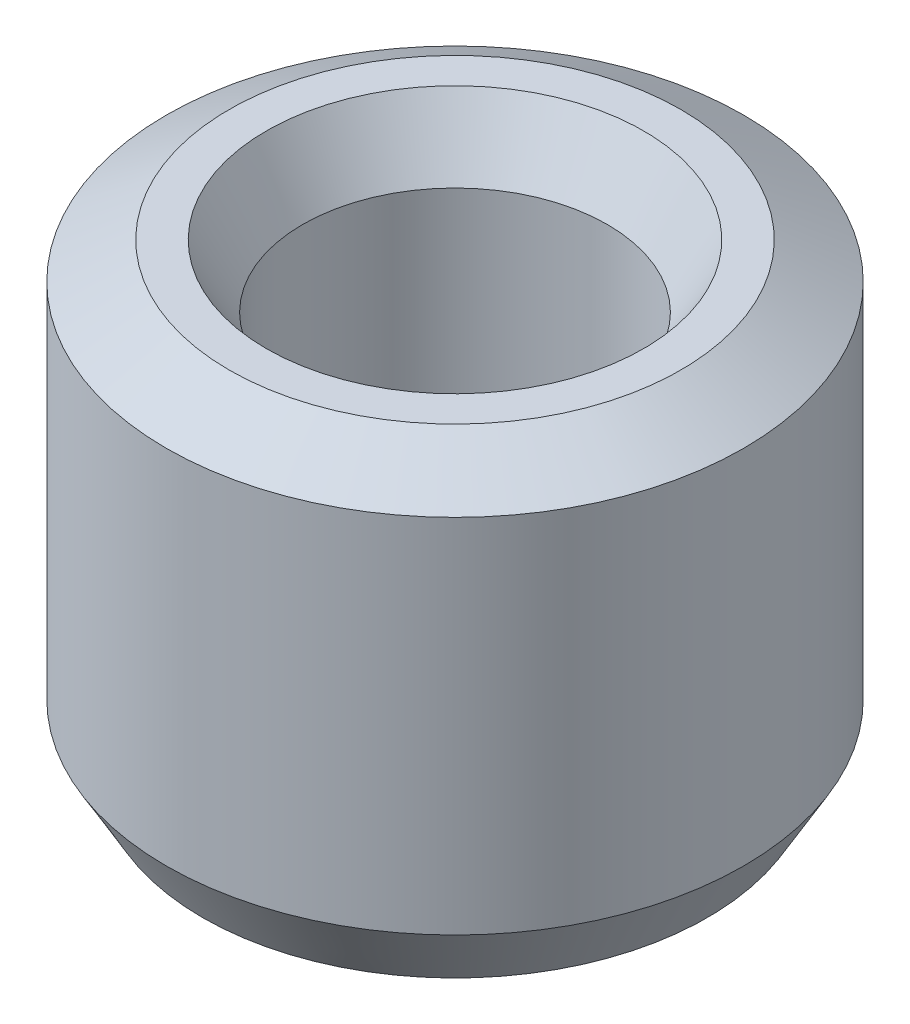
ISO-10303-21;
HEADER;
FILE_DESCRIPTION(('STEP AP214'),'2;1');
FILE_NAME('part.step','',(''),(''),'','','');
FILE_SCHEMA(('AUTOMOTIVE_DESIGN { 1 0 10303 214 1 1 1 1 }'));
ENDSEC;
DATA;
#1=APPLICATION_CONTEXT('core data for automotive mechanical design processes');
#2=APPLICATION_PROTOCOL_DEFINITION('international standard','automotive_design',2000,#1);
#3=PRODUCT_CONTEXT('',#1,'mechanical');
#4=PRODUCT('Part','Part','',(#3));
#5=PRODUCT_RELATED_PRODUCT_CATEGORY('part','',(#4));
#6=PRODUCT_DEFINITION_FORMATION('','',#4);
#7=PRODUCT_DEFINITION_CONTEXT('part definition',#1,'design');
#8=PRODUCT_DEFINITION('design','',#6,#7);
#9=PRODUCT_DEFINITION_SHAPE('','',#8);
#10=(LENGTH_UNIT() NAMED_UNIT(*) SI_UNIT(.MILLI.,.METRE.));
#11=(NAMED_UNIT(*) PLANE_ANGLE_UNIT() SI_UNIT($,.RADIAN.));
#12=(NAMED_UNIT(*) SI_UNIT($,.STERADIAN.) SOLID_ANGLE_UNIT());
#13=UNCERTAINTY_MEASURE_WITH_UNIT(LENGTH_MEASURE(1.E-05),#10,'distance_accuracy_value','');
#14=(GEOMETRIC_REPRESENTATION_CONTEXT(3) GLOBAL_UNCERTAINTY_ASSIGNED_CONTEXT((#13)) GLOBAL_UNIT_ASSIGNED_CONTEXT((#10,
#11,#12)) REPRESENTATION_CONTEXT('',''));
#15=CARTESIAN_POINT('',(0.,0.,0.));
#16=DIRECTION('',(0.,0.,1.));
#17=DIRECTION('',(1.,0.,0.));
#18=AXIS2_PLACEMENT_3D('',#15,#16,#17);
#19=CARTESIAN_POINT('',(0.,43.9121580539142,0.));
#20=DIRECTION('',(0.,-1.,0.));
#21=DIRECTION('',(0.,0.,-1.));
#22=AXIS2_PLACEMENT_3D('',#19,#20,#21);
#23=CYLINDRICAL_SURFACE('',#22,27.5);
#24=CARTESIAN_POINT('',(0.,5.99202344229953,0.));
#25=DIRECTION('',(0.,1.,0.));
#26=DIRECTION('',(0.,0.,1.));
#27=AXIS2_PLACEMENT_3D('',#24,#25,#26);
#28=CIRCLE('',#27,27.5);
#29=CARTESIAN_POINT('',(0.,5.99202344229953,27.5));
#30=VERTEX_POINT('',#29);
#31=EDGE_CURVE('E10',#30,#30,#28,.T.);
#32=ORIENTED_EDGE('',*,*,#31,.T.);
#33=EDGE_LOOP('',(#32));
#34=FACE_BOUND('',#33,.T.);
#35=CARTESIAN_POINT('',(0.,40.4526617065119,0.));
#36=DIRECTION('',(0.,1.,0.));
#37=DIRECTION('',(0.,0.,1.));
#38=AXIS2_PLACEMENT_3D('',#35,#36,#37);
#39=CIRCLE('',#38,27.5);
#40=CARTESIAN_POINT('',(0.,40.4526617065119,-27.5));
#41=VERTEX_POINT('',#40);
#42=EDGE_CURVE('E50',#41,#41,#39,.F.);
#43=ORIENTED_EDGE('',*,*,#42,.T.);
#44=EDGE_LOOP('',(#43));
#45=FACE_BOUND('',#44,.T.);
#46=ADVANCED_FACE('F39',(#34,#45),#23,.T.);
#47=CARTESIAN_POINT('',(0.,43.9121580539142,0.));
#48=DIRECTION('',(0.,1.,0.));
#49=DIRECTION('',(0.,0.,1.));
#50=AXIS2_PLACEMENT_3D('',#47,#48,#49);
#51=PLANE('',#50);
#52=CARTESIAN_POINT('',(0.,43.9121580539142,0.));
#53=DIRECTION('',(0.,1.,0.));
#54=DIRECTION('',(0.,0.,1.));
#55=AXIS2_PLACEMENT_3D('',#52,#53,#54);
#56=CIRCLE('',#55,17.9725590575478);
#57=CARTESIAN_POINT('',(0.,43.9121580539141,17.9725590575478));
#58=VERTEX_POINT('',#57);
#59=EDGE_CURVE('E58',#58,#58,#56,.F.);
#60=ORIENTED_EDGE('',*,*,#59,.T.);
#61=EDGE_LOOP('',(#60));
#62=FACE_BOUND('',#61,.T.);
#63=CARTESIAN_POINT('',(0.,43.9121580539142,0.));
#64=DIRECTION('',(0.,1.,0.));
#65=DIRECTION('',(0.,0.,1.));
#66=AXIS2_PLACEMENT_3D('',#63,#64,#65);
#67=CIRCLE('',#66,21.5079765577005);
#68=CARTESIAN_POINT('',(0.,43.9121580539141,-21.5079765577005));
#69=VERTEX_POINT('',#68);
#70=EDGE_CURVE('E61',#69,#69,#67,.T.);
#71=ORIENTED_EDGE('',*,*,#70,.T.);
#72=EDGE_LOOP('',(#71));
#73=FACE_BOUND('',#72,.T.);
#74=ADVANCED_FACE('F88',(#62,#73),#51,.T.);
#75=CARTESIAN_POINT('',(0.,0.,0.));
#76=DIRECTION('',(0.,1.,0.));
#77=DIRECTION('',(0.,0.,1.));
#78=AXIS2_PLACEMENT_3D('',#75,#76,#77);
#79=PLANE('',#78);
#80=CARTESIAN_POINT('',(0.,0.,0.));
#81=DIRECTION('',(0.,1.,0.));
#82=DIRECTION('',(0.,0.,1.));
#83=AXIS2_PLACEMENT_3D('',#80,#81,#82);
#84=CIRCLE('',#83,20.5050861524451);
#85=CARTESIAN_POINT('',(0.,0.,20.5050861524451));
#86=VERTEX_POINT('',#85);
#87=EDGE_CURVE('E51',#86,#86,#84,.T.);
#88=ORIENTED_EDGE('',*,*,#87,.T.);
#89=EDGE_LOOP('',(#88));
#90=FACE_BOUND('',#89,.T.);
#91=CARTESIAN_POINT('',(0.,0.,0.));
#92=DIRECTION('',(0.,1.,0.));
#93=DIRECTION('',(0.,0.,1.));
#94=AXIS2_PLACEMENT_3D('',#91,#92,#93);
#95=CIRCLE('',#94,24.0405036525978);
#96=CARTESIAN_POINT('',(0.,0.,24.0405036525978));
#97=VERTEX_POINT('',#96);
#98=EDGE_CURVE('E54',#97,#97,#95,.F.);
#99=ORIENTED_EDGE('',*,*,#98,.T.);
#100=EDGE_LOOP('',(#99));
#101=FACE_BOUND('',#100,.T.);
#102=ADVANCED_FACE('F83',(#90,#101),#79,.F.);
#103=CARTESIAN_POINT('',(0.,43.9121580539142,0.));
#104=DIRECTION('',(0.,-1.,0.));
#105=DIRECTION('',(0.,0.,-1.));
#106=AXIS2_PLACEMENT_3D('',#103,#104,#105);
#107=CYLINDRICAL_SURFACE('',#106,14.5130627101456);
#108=CARTESIAN_POINT('',(0.,37.9201346116146,0.));
#109=DIRECTION('',(0.,1.,0.));
#110=DIRECTION('',(0.,0.,1.));
#111=AXIS2_PLACEMENT_3D('',#108,#109,#110);
#112=CIRCLE('',#111,14.5130627101456);
#113=CARTESIAN_POINT('',(0.,37.9201346116146,14.5130627101456));
#114=VERTEX_POINT('',#113);
#115=EDGE_CURVE('E67',#114,#114,#112,.T.);
#116=ORIENTED_EDGE('',*,*,#115,.T.);
#117=EDGE_LOOP('',(#116));
#118=FACE_BOUND('',#117,.T.);
#119=CARTESIAN_POINT('',(0.,3.45949634740222,0.));
#120=DIRECTION('',(0.,1.,0.));
#121=DIRECTION('',(0.,0.,1.));
#122=AXIS2_PLACEMENT_3D('',#119,#120,#121);
#123=CIRCLE('',#122,14.5130627101456);
#124=CARTESIAN_POINT('',(0.,3.45949634740222,14.5130627101456));
#125=VERTEX_POINT('',#124);
#126=EDGE_CURVE('E69',#125,#125,#123,.F.);
#127=ORIENTED_EDGE('',*,*,#126,.T.);
#128=EDGE_LOOP('',(#127));
#129=FACE_BOUND('',#128,.T.);
#130=ADVANCED_FACE('F71',(#118,#129),#107,.F.);
#131=CARTESIAN_POINT('',(0.,37.9201346116146,0.));
#132=DIRECTION('',(0.,1.,0.));
#133=DIRECTION('',(0.,0.,1.));
#134=AXIS2_PLACEMENT_3D('',#131,#132,#133);
#135=CONICAL_SURFACE('',#134,14.5130627101456,0.523598775598303);
#136=CARTESIAN_POINT('',(0.,43.9121580539141,17.9725590575478));
#137=CARTESIAN_POINT('',(0.,43.8497411430569,17.9365226372624));
#138=CARTESIAN_POINT('',(0.,43.7873242321996,17.9004862169769));
#139=CARTESIAN_POINT('',(0.,43.662490410485,17.8284133764061));
#140=CARTESIAN_POINT('',(0.,43.6000734996277,17.7923769561206));
#141=CARTESIAN_POINT('',(0.,43.4752396779131,17.7203041155497));
#142=CARTESIAN_POINT('',(0.,43.4128227670559,17.6842676952643));
#143=CARTESIAN_POINT('',(0.,43.2879889453413,17.6121948546934));
#144=CARTESIAN_POINT('',(0.,43.225572034484,17.576158434408));
#145=CARTESIAN_POINT('',(0.,43.1007382127694,17.5040855938371));
#146=CARTESIAN_POINT('',(0.,43.0383213019121,17.4680491735517));
#147=CARTESIAN_POINT('',(0.,42.9134874801976,17.3959763329808));
#148=CARTESIAN_POINT('',(0.,42.8510705693403,17.3599399126953));
#149=CARTESIAN_POINT('',(0.,42.7262367476257,17.2878670721245));
#150=CARTESIAN_POINT('',(0.,42.6638198367684,17.251830651839));
#151=CARTESIAN_POINT('',(0.,42.5389860150538,17.1797578112681));
#152=CARTESIAN_POINT('',(0.,42.4765691041965,17.1437213909827));
#153=CARTESIAN_POINT('',(0.,42.351735282482,17.0716485504118));
#154=CARTESIAN_POINT('',(0.,42.2893183716247,17.0356121301264));
#155=CARTESIAN_POINT('',(0.,42.1644845499101,16.9635392895555));
#156=CARTESIAN_POINT('',(0.,42.1020676390528,16.9275028692701));
#157=CARTESIAN_POINT('',(0.,41.9772338173383,16.8554300286992));
#158=CARTESIAN_POINT('',(0.,41.914816906481,16.8193936084137));
#159=CARTESIAN_POINT('',(0.,41.7899830847664,16.7473207678429));
#160=CARTESIAN_POINT('',(0.,41.7275661739091,16.7112843475574));
#161=CARTESIAN_POINT('',(0.,41.6027323521945,16.6392115069865));
#162=CARTESIAN_POINT('',(0.,41.5403154413372,16.6031750867011));
#163=CARTESIAN_POINT('',(0.,41.4154816196227,16.5311022461302));
#164=CARTESIAN_POINT('',(0.,41.3530647087654,16.4950658258448));
#165=CARTESIAN_POINT('',(0.,41.2282308870508,16.4229929852739));
#166=CARTESIAN_POINT('',(0.,41.1658139761935,16.3869565649885));
#167=CARTESIAN_POINT('',(0.,41.040980154479,16.3148837244176));
#168=CARTESIAN_POINT('',(0.,40.9785632436217,16.2788473041321));
#169=CARTESIAN_POINT('',(0.,40.8537294219071,16.2067744635613));
#170=CARTESIAN_POINT('',(0.,40.7913125110498,16.1707380432758));
#171=CARTESIAN_POINT('',(0.,40.6664786893352,16.0986652027049));
#172=CARTESIAN_POINT('',(0.,40.6040617784779,16.0626287824195));
#173=CARTESIAN_POINT('',(0.,40.4792279567634,15.9905559418486));
#174=CARTESIAN_POINT('',(0.,40.4168110459061,15.9545195215632));
#175=CARTESIAN_POINT('',(0.,40.2919772241915,15.8824466809923));
#176=CARTESIAN_POINT('',(0.,40.2295603133342,15.8464102607069));
#177=CARTESIAN_POINT('',(0.,40.1047264916196,15.774337420136));
#178=CARTESIAN_POINT('',(0.,40.0423095807624,15.7383009998505));
#179=CARTESIAN_POINT('',(0.,39.9174757590478,15.6662281592797));
#180=CARTESIAN_POINT('',(0.,39.8550588481905,15.6301917389942));
#181=CARTESIAN_POINT('',(0.,39.7302250264759,15.5581188984233));
#182=CARTESIAN_POINT('',(0.,39.6678081156186,15.5220824781379));
#183=CARTESIAN_POINT('',(0.,39.5429742939041,15.450009637567));
#184=CARTESIAN_POINT('',(0.,39.4805573830468,15.4139732172816));
#185=CARTESIAN_POINT('',(0.,39.3557235613322,15.3419003767107));
#186=CARTESIAN_POINT('',(0.,39.2933066504749,15.3058639564253));
#187=CARTESIAN_POINT('',(0.,39.1684728287603,15.2337911158544));
#188=CARTESIAN_POINT('',(0.,39.1060559179031,15.1977546955689));
#189=CARTESIAN_POINT('',(0.,38.9812220961885,15.1256818549981));
#190=CARTESIAN_POINT('',(0.,38.9188051853312,15.0896454347126));
#191=CARTESIAN_POINT('',(0.,38.7939713636166,15.0175725941417));
#192=CARTESIAN_POINT('',(0.,38.7315544527593,14.9815361738563));
#193=CARTESIAN_POINT('',(0.,38.6067206310448,14.9094633332854));
#194=CARTESIAN_POINT('',(0.,38.5443037201875,14.873426913));
#195=CARTESIAN_POINT('',(0.,38.4194698984729,14.8013540724291));
#196=CARTESIAN_POINT('',(0.,38.3570529876156,14.7653176521437));
#197=CARTESIAN_POINT('',(0.,38.232219165901,14.6932448115728));
#198=CARTESIAN_POINT('',(0.,38.1698022550437,14.6572083912873));
#199=CARTESIAN_POINT('',(0.,38.0449684333292,14.5851355507165));
#200=CARTESIAN_POINT('',(0.,37.9825515224719,14.549099130431));
#201=CARTESIAN_POINT('',(0.,37.9201346116146,14.5130627101456));
#202=B_SPLINE_CURVE_WITH_KNOTS('',3,(#136,#137,#138,#139,#140,#141,#142,#143,#144,#145,#146,
#147,#148,#149,#150,#151,#152,#153,#154,#155,#156,#157,#158,#159,#160,#161,#162,#163,#164,#165,
#166,#167,#168,#169,#170,#171,#172,#173,#174,#175,#176,#177,#178,#179,#180,#181,#182,#183,#184,
#185,#186,#187,#188,#189,#190,#191,#192,#193,#194,#195,#196,#197,#198,#199,#200,#201),
.UNSPECIFIED.,.F.,.F.,(4,2,2,2,2,2,2,2,2,2,2,2,2,2,2,2,2,2,2,2,2,2,2,2,2,2,2,2,2,2,2,2,4),(0.,
0.216218521712634,0.432437043425275,0.648655565137908,0.864874086850549,1.08109260856318,
1.29731113027582,1.51352965198847,1.7297481737011,1.94596669541374,2.16218521712637,
2.37840373883901,2.59462226055165,2.81084078226429,3.02705930397692,3.24327782568956,
3.4594963474022,3.67571486911484,3.89193339082748,4.10815191254011,4.32437043425275,
4.54058895596539,4.75680747767803,4.97302599939067,5.18924452110331,5.40546304281595,
5.62168156452858,5.83790008624122,6.05411860795386,6.2703371296665,6.48655565137913,
6.70277417309177,6.91899269480441),.UNSPECIFIED.);
#203=EDGE_CURVE('BSEAM77',#58,#114,#202,.T.);
#204=ORIENTED_EDGE('',*,*,#59,.F.);
#205=ORIENTED_EDGE('',*,*,#115,.F.);
#206=ORIENTED_EDGE('',*,*,#203,.T.);
#207=ORIENTED_EDGE('',*,*,#203,.F.);
#208=EDGE_LOOP('',(#204,#206,#205,#207));
#209=FACE_BOUND('',#208,.T.);
#210=ADVANCED_FACE('F77',(#209),#135,.F.);
#211=CARTESIAN_POINT('',(0.,0.,0.));
#212=DIRECTION('',(0.,-1.,0.));
#213=DIRECTION('',(0.,0.,-1.));
#214=AXIS2_PLACEMENT_3D('',#211,#212,#213);
#215=CONICAL_SURFACE('',#214,20.5050861524451,1.04719755119659);
#216=ORIENTED_EDGE('',*,*,#126,.F.);
#217=EDGE_LOOP('',(#216));
#218=FACE_BOUND('',#217,.T.);
#219=ORIENTED_EDGE('',*,*,#87,.F.);
#220=EDGE_LOOP('',(#219));
#221=FACE_BOUND('',#220,.T.);
#222=ADVANCED_FACE('F73',(#218,#221),#215,.F.);
#223=CARTESIAN_POINT('',(0.,5.99202344229953,0.));
#224=DIRECTION('',(0.,1.,0.));
#225=DIRECTION('',(0.,0.,1.));
#226=AXIS2_PLACEMENT_3D('',#223,#224,#225);
#227=CONICAL_SURFACE('',#226,27.5,0.523598775598303);
#228=ORIENTED_EDGE('',*,*,#98,.F.);
#229=EDGE_LOOP('',(#228));
#230=FACE_BOUND('',#229,.T.);
#231=ORIENTED_EDGE('',*,*,#31,.F.);
#232=EDGE_LOOP('',(#231));
#233=FACE_BOUND('',#232,.T.);
#234=ADVANCED_FACE('F76',(#230,#233),#227,.T.);
#235=CARTESIAN_POINT('',(0.,43.9121580539142,0.));
#236=DIRECTION('',(0.,-1.,0.));
#237=DIRECTION('',(0.,0.,-1.));
#238=AXIS2_PLACEMENT_3D('',#235,#236,#237);
#239=CONICAL_SURFACE('',#238,21.5079765577005,1.04719755119659);
#240=CARTESIAN_POINT('',(0.,40.4526617065119,-27.5));
#241=CARTESIAN_POINT('',(0.,40.4886981267974,-27.4375830891427));
#242=CARTESIAN_POINT('',(0.,40.5247345470828,-27.3751661782854));
#243=CARTESIAN_POINT('',(0.,40.5968073876537,-27.2503323565709));
#244=CARTESIAN_POINT('',(0.,40.6328438079391,-27.1879154457136));
#245=CARTESIAN_POINT('',(0.,40.70491664851,-27.063081623999));
#246=CARTESIAN_POINT('',(0.,40.7409530687955,-27.0006647131417));
#247=CARTESIAN_POINT('',(0.,40.8130259093663,-26.8758308914271));
#248=CARTESIAN_POINT('',(0.,40.8490623296518,-26.8134139805699));
#249=CARTESIAN_POINT('',(0.,40.9211351702227,-26.6885801588553));
#250=CARTESIAN_POINT('',(0.,40.9571715905081,-26.626163247998));
#251=CARTESIAN_POINT('',(0.,41.029244431079,-26.5013294262834));
#252=CARTESIAN_POINT('',(0.,41.0652808513644,-26.4389125154261));
#253=CARTESIAN_POINT('',(0.,41.1373536919353,-26.3140786937116));
#254=CARTESIAN_POINT('',(0.,41.1733901122207,-26.2516617828543));
#255=CARTESIAN_POINT('',(0.,41.2454629527916,-26.1268279611397));
#256=CARTESIAN_POINT('',(0.,41.2814993730771,-26.0644110502824));
#257=CARTESIAN_POINT('',(0.,41.3535722136479,-25.9395772285678));
#258=CARTESIAN_POINT('',(0.,41.3896086339334,-25.8771603177106));
#259=CARTESIAN_POINT('',(0.,41.4616814745043,-25.752326495996));
#260=CARTESIAN_POINT('',(0.,41.4977178947897,-25.6899095851387));
#261=CARTESIAN_POINT('',(0.,41.5697907353606,-25.5650757634241));
#262=CARTESIAN_POINT('',(0.,41.605827155646,-25.5026588525668));
#263=CARTESIAN_POINT('',(0.,41.6778999962169,-25.3778250308523));
#264=CARTESIAN_POINT('',(0.,41.7139364165023,-25.315408119995));
#265=CARTESIAN_POINT('',(0.,41.7860092570732,-25.1905742982804));
#266=CARTESIAN_POINT('',(0.,41.8220456773587,-25.1281573874231));
#267=CARTESIAN_POINT('',(0.,41.8941185179295,-25.0033235657085));
#268=CARTESIAN_POINT('',(0.,41.930154938215,-24.9409066548512));
#269=CARTESIAN_POINT('',(0.,42.0022277787859,-24.8160728331367));
#270=CARTESIAN_POINT('',(0.,42.0382641990713,-24.7536559222794));
#271=CARTESIAN_POINT('',(0.,42.1103370396422,-24.6288221005648));
#272=CARTESIAN_POINT('',(0.,42.1463734599276,-24.5664051897075));
#273=CARTESIAN_POINT('',(0.,42.2184463004985,-24.441571367993));
#274=CARTESIAN_POINT('',(0.,42.2544827207839,-24.3791544571357));
#275=CARTESIAN_POINT('',(0.,42.3265555613548,-24.2543206354211));
#276=CARTESIAN_POINT('',(0.,42.3625919816402,-24.1919037245638));
#277=CARTESIAN_POINT('',(0.,42.4346648222111,-24.0670699028492));
#278=CARTESIAN_POINT('',(0.,42.4707012424966,-24.0046529919919));
#279=CARTESIAN_POINT('',(0.,42.5427740830674,-23.8798191702774));
#280=CARTESIAN_POINT('',(0.,42.5788105033529,-23.8174022594201));
#281=CARTESIAN_POINT('',(0.,42.6508833439238,-23.6925684377055));
#282=CARTESIAN_POINT('',(0.,42.6869197642092,-23.6301515268482));
#283=CARTESIAN_POINT('',(0.,42.7589926047801,-23.5053177051336));
#284=CARTESIAN_POINT('',(0.,42.7950290250655,-23.4429007942764));
#285=CARTESIAN_POINT('',(0.,42.8671018656364,-23.3180669725618));
#286=CARTESIAN_POINT('',(0.,42.9031382859218,-23.2556500617045));
#287=CARTESIAN_POINT('',(0.,42.9752111264927,-23.1308162399899));
#288=CARTESIAN_POINT('',(0.,43.0112475467782,-23.0683993291326));
#289=CARTESIAN_POINT('',(0.,43.083320387349,-22.9435655074181));
#290=CARTESIAN_POINT('',(0.,43.1193568076345,-22.8811485965608));
#291=CARTESIAN_POINT('',(0.,43.1914296482054,-22.7563147748462));
#292=CARTESIAN_POINT('',(0.,43.2274660684908,-22.6938978639889));
#293=CARTESIAN_POINT('',(0.,43.2995389090617,-22.5690640422743));
#294=CARTESIAN_POINT('',(0.,43.3355753293471,-22.5066471314171));
#295=CARTESIAN_POINT('',(0.,43.407648169918,-22.3818133097025));
#296=CARTESIAN_POINT('',(0.,43.4436845902034,-22.3193963988452));
#297=CARTESIAN_POINT('',(0.,43.5157574307743,-22.1945625771306));
#298=CARTESIAN_POINT('',(0.,43.5517938510598,-22.1321456662733));
#299=CARTESIAN_POINT('',(0.,43.6238666916306,-22.0073118445588));
#300=CARTESIAN_POINT('',(0.,43.6599031119161,-21.9448949337015));
#301=CARTESIAN_POINT('',(0.,43.731975952487,-21.8200611119869));
#302=CARTESIAN_POINT('',(0.,43.7680123727724,-21.7576442011296));
#303=CARTESIAN_POINT('',(0.,43.8400852133433,-21.632810379415));
#304=CARTESIAN_POINT('',(0.,43.8761216336287,-21.5703934685578));
#305=CARTESIAN_POINT('',(0.,43.9121580539142,-21.5079765577005));
#306=B_SPLINE_CURVE_WITH_KNOTS('',3,(#240,#241,#242,#243,#244,#245,#246,#247,#248,#249,#250,
#251,#252,#253,#254,#255,#256,#257,#258,#259,#260,#261,#262,#263,#264,#265,#266,#267,#268,#269,
#270,#271,#272,#273,#274,#275,#276,#277,#278,#279,#280,#281,#282,#283,#284,#285,#286,#287,#288,
#289,#290,#291,#292,#293,#294,#295,#296,#297,#298,#299,#300,#301,#302,#303,#304,#305),
.UNSPECIFIED.,.F.,.F.,(4,2,2,2,2,2,2,2,2,2,2,2,2,2,2,2,2,2,2,2,2,2,2,2,2,2,2,2,2,2,2,2,4),(0.,
0.21621852171264,0.432437043425277,0.648655565137913,0.864874086850547,1.08109260856318,
1.29731113027582,1.51352965198846,1.7297481737011,1.94596669541373,2.16218521712637,
2.37840373883901,2.59462226055164,2.81084078226428,3.02705930397692,3.24327782568955,
3.45949634740219,3.67571486911483,3.89193339082746,4.1081519125401,4.32437043425274,
4.54058895596537,4.75680747767801,4.97302599939065,5.18924452110329,5.40546304281592,
5.62168156452856,5.8379000862412,6.05411860795384,6.27033712966647,6.48655565137911,
6.70277417309174,6.91899269480438),.UNSPECIFIED.);
#307=EDGE_CURVE('BSEAM45',#41,#69,#306,.T.);
#308=ORIENTED_EDGE('',*,*,#42,.F.);
#309=ORIENTED_EDGE('',*,*,#70,.F.);
#310=ORIENTED_EDGE('',*,*,#307,.T.);
#311=ORIENTED_EDGE('',*,*,#307,.F.);
#312=EDGE_LOOP('',(#308,#310,#309,#311));
#313=FACE_BOUND('',#312,.T.);
#314=ADVANCED_FACE('F45',(#313),#239,.T.);
#315=CLOSED_SHELL('',(#46,#74,#102,#130,#210,#222,#234,#314));
#316=MANIFOLD_SOLID_BREP('B2',#315);
#317=ADVANCED_BREP_SHAPE_REPRESENTATION('',(#18,#316),#14);
#318=SHAPE_DEFINITION_REPRESENTATION(#9,#317);
ENDSEC;
END-ISO-10303-21;
